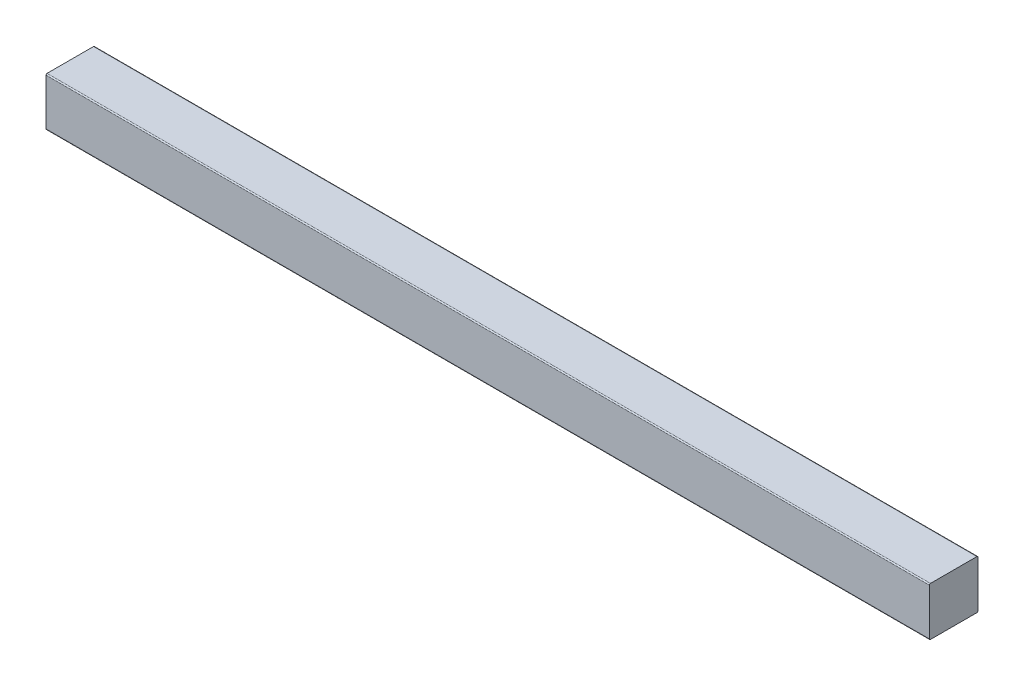
ISO-10303-21;
HEADER;
FILE_DESCRIPTION(('STEP AP214'),'2;1');
FILE_NAME('part.step','',(''),(''),'','','');
FILE_SCHEMA(('AUTOMOTIVE_DESIGN { 1 0 10303 214 1 1 1 1 }'));
ENDSEC;
DATA;
#1=APPLICATION_CONTEXT('core data for automotive mechanical design processes');
#2=APPLICATION_PROTOCOL_DEFINITION('international standard','automotive_design',2000,#1);
#3=PRODUCT_CONTEXT('',#1,'mechanical');
#4=PRODUCT('Part','Part','',(#3));
#5=PRODUCT_RELATED_PRODUCT_CATEGORY('part','',(#4));
#6=PRODUCT_DEFINITION_FORMATION('','',#4);
#7=PRODUCT_DEFINITION_CONTEXT('part definition',#1,'design');
#8=PRODUCT_DEFINITION('design','',#6,#7);
#9=PRODUCT_DEFINITION_SHAPE('','',#8);
#10=(LENGTH_UNIT() NAMED_UNIT(*) SI_UNIT(.MILLI.,.METRE.));
#11=(NAMED_UNIT(*) PLANE_ANGLE_UNIT() SI_UNIT($,.RADIAN.));
#12=(NAMED_UNIT(*) SI_UNIT($,.STERADIAN.) SOLID_ANGLE_UNIT());
#13=UNCERTAINTY_MEASURE_WITH_UNIT(LENGTH_MEASURE(1.E-05),#10,'distance_accuracy_value','');
#14=(GEOMETRIC_REPRESENTATION_CONTEXT(3) GLOBAL_UNCERTAINTY_ASSIGNED_CONTEXT((#13)) GLOBAL_UNIT_ASSIGNED_CONTEXT((#10,
#11,#12)) REPRESENTATION_CONTEXT('',''));
#15=CARTESIAN_POINT('',(0.,0.,0.));
#16=DIRECTION('',(0.,0.,1.));
#17=DIRECTION('',(1.,0.,0.));
#18=AXIS2_PLACEMENT_3D('',#15,#16,#17);
#19=CARTESIAN_POINT('',(800.,0.,0.));
#20=DIRECTION('',(0.,0.,-1.));
#21=DIRECTION('',(-1.,0.,0.));
#22=AXIS2_PLACEMENT_3D('',#19,#20,#21);
#23=PLANE('',#22);
#24=DIRECTION('',(0.,-1.,0.));
#25=VECTOR('',#24,1.);
#26=CARTESIAN_POINT('',(0.,0.,0.));
#27=LINE('',#26,#25);
#28=CARTESIAN_POINT('',(0.,43.,0.));
#29=VERTEX_POINT('',#28);
#30=CARTESIAN_POINT('',(0.,1.,0.));
#31=VERTEX_POINT('',#30);
#32=EDGE_CURVE('E148',#29,#31,#27,.T.);
#33=ORIENTED_EDGE('',*,*,#32,.T.);
#34=DIRECTION('',(-1.,0.,0.));
#35=VECTOR('',#34,1.);
#36=CARTESIAN_POINT('',(800.,1.,0.));
#37=LINE('',#36,#35);
#38=CARTESIAN_POINT('',(800.,1.,0.));
#39=VERTEX_POINT('',#38);
#40=EDGE_CURVE('E181',#31,#39,#37,.F.);
#41=ORIENTED_EDGE('',*,*,#40,.T.);
#42=DIRECTION('',(0.,-1.,0.));
#43=VECTOR('',#42,1.);
#44=CARTESIAN_POINT('',(800.,0.,0.));
#45=LINE('',#44,#43);
#46=CARTESIAN_POINT('',(800.,43.,0.));
#47=VERTEX_POINT('',#46);
#48=EDGE_CURVE('E146',#47,#39,#45,.T.);
#49=ORIENTED_EDGE('',*,*,#48,.F.);
#50=DIRECTION('',(-1.,0.,0.));
#51=VECTOR('',#50,1.);
#52=CARTESIAN_POINT('',(800.,43.,0.));
#53=LINE('',#52,#51);
#54=EDGE_CURVE('E177',#47,#29,#53,.T.);
#55=ORIENTED_EDGE('',*,*,#54,.T.);
#56=EDGE_LOOP('',(#33,#41,#49,#55));
#57=FACE_BOUND('',#56,.T.);
#58=ADVANCED_FACE('F45',(#57),#23,.F.);
#59=CARTESIAN_POINT('',(800.,0.,0.));
#60=DIRECTION('',(0.,1.,0.));
#61=DIRECTION('',(0.,0.,1.));
#62=AXIS2_PLACEMENT_3D('',#59,#60,#61);
#63=PLANE('',#62);
#64=DIRECTION('',(0.,0.,-1.));
#65=VECTOR('',#64,1.);
#66=CARTESIAN_POINT('',(0.,0.,0.));
#67=LINE('',#66,#65);
#68=CARTESIAN_POINT('',(0.,0.,-1.));
#69=VERTEX_POINT('',#68);
#70=CARTESIAN_POINT('',(0.,0.,-43.));
#71=VERTEX_POINT('',#70);
#72=EDGE_CURVE('E142',#69,#71,#67,.T.);
#73=ORIENTED_EDGE('',*,*,#72,.T.);
#74=DIRECTION('',(-1.,0.,0.));
#75=VECTOR('',#74,1.);
#76=CARTESIAN_POINT('',(800.,0.,-43.));
#77=LINE('',#76,#75);
#78=CARTESIAN_POINT('',(800.,0.,-43.));
#79=VERTEX_POINT('',#78);
#80=EDGE_CURVE('E117',#71,#79,#77,.F.);
#81=ORIENTED_EDGE('',*,*,#80,.T.);
#82=DIRECTION('',(0.,0.,-1.));
#83=VECTOR('',#82,1.);
#84=CARTESIAN_POINT('',(800.,0.,0.));
#85=LINE('',#84,#83);
#86=CARTESIAN_POINT('',(800.,0.,-1.));
#87=VERTEX_POINT('',#86);
#88=EDGE_CURVE('E188',#87,#79,#85,.T.);
#89=ORIENTED_EDGE('',*,*,#88,.F.);
#90=DIRECTION('',(-1.,0.,0.));
#91=VECTOR('',#90,1.);
#92=CARTESIAN_POINT('',(800.,0.,-1.));
#93=LINE('',#92,#91);
#94=EDGE_CURVE('E123',#87,#69,#93,.T.);
#95=ORIENTED_EDGE('',*,*,#94,.T.);
#96=EDGE_LOOP('',(#73,#81,#89,#95));
#97=FACE_BOUND('',#96,.T.);
#98=ADVANCED_FACE('F209',(#97),#63,.F.);
#99=CARTESIAN_POINT('',(800.,0.,-44.));
#100=DIRECTION('',(0.,0.,1.));
#101=DIRECTION('',(1.,0.,0.));
#102=AXIS2_PLACEMENT_3D('',#99,#100,#101);
#103=PLANE('',#102);
#104=DIRECTION('',(0.,1.,0.));
#105=VECTOR('',#104,1.);
#106=CARTESIAN_POINT('',(800.,0.,-44.));
#107=LINE('',#106,#105);
#108=CARTESIAN_POINT('',(800.,1.,-44.));
#109=VERTEX_POINT('',#108);
#110=CARTESIAN_POINT('',(800.,43.,-44.));
#111=VERTEX_POINT('',#110);
#112=EDGE_CURVE('E132',#109,#111,#107,.T.);
#113=ORIENTED_EDGE('',*,*,#112,.F.);
#114=DIRECTION('',(-1.,0.,0.));
#115=VECTOR('',#114,1.);
#116=CARTESIAN_POINT('',(800.,1.,-44.));
#117=LINE('',#116,#115);
#118=CARTESIAN_POINT('',(0.,1.,-44.));
#119=VERTEX_POINT('',#118);
#120=EDGE_CURVE('E116',#109,#119,#117,.T.);
#121=ORIENTED_EDGE('',*,*,#120,.T.);
#122=DIRECTION('',(0.,1.,0.));
#123=VECTOR('',#122,1.);
#124=CARTESIAN_POINT('',(0.,0.,-44.));
#125=LINE('',#124,#123);
#126=CARTESIAN_POINT('',(0.,43.,-44.));
#127=VERTEX_POINT('',#126);
#128=EDGE_CURVE('E130',#119,#127,#125,.T.);
#129=ORIENTED_EDGE('',*,*,#128,.T.);
#130=DIRECTION('',(-1.,0.,0.));
#131=VECTOR('',#130,1.);
#132=CARTESIAN_POINT('',(800.,43.,-44.));
#133=LINE('',#132,#131);
#134=EDGE_CURVE('E135',#127,#111,#133,.F.);
#135=ORIENTED_EDGE('',*,*,#134,.T.);
#136=EDGE_LOOP('',(#113,#121,#129,#135));
#137=FACE_BOUND('',#136,.T.);
#138=ADVANCED_FACE('F129',(#137),#103,.F.);
#139=CARTESIAN_POINT('',(800.,44.,0.));
#140=DIRECTION('',(0.,-1.,0.));
#141=DIRECTION('',(0.,0.,-1.));
#142=AXIS2_PLACEMENT_3D('',#139,#140,#141);
#143=PLANE('',#142);
#144=DIRECTION('',(0.,0.,1.));
#145=VECTOR('',#144,1.);
#146=CARTESIAN_POINT('',(800.,44.,0.));
#147=LINE('',#146,#145);
#148=CARTESIAN_POINT('',(800.,44.,-43.));
#149=VERTEX_POINT('',#148);
#150=CARTESIAN_POINT('',(800.,44.,-1.));
#151=VERTEX_POINT('',#150);
#152=EDGE_CURVE('E153',#149,#151,#147,.T.);
#153=ORIENTED_EDGE('',*,*,#152,.F.);
#154=DIRECTION('',(-1.,0.,0.));
#155=VECTOR('',#154,1.);
#156=CARTESIAN_POINT('',(800.,44.,-43.));
#157=LINE('',#156,#155);
#158=CARTESIAN_POINT('',(0.,44.,-43.));
#159=VERTEX_POINT('',#158);
#160=EDGE_CURVE('E11',#149,#159,#157,.T.);
#161=ORIENTED_EDGE('',*,*,#160,.T.);
#162=DIRECTION('',(0.,0.,1.));
#163=VECTOR('',#162,1.);
#164=CARTESIAN_POINT('',(0.,44.,0.));
#165=LINE('',#164,#163);
#166=CARTESIAN_POINT('',(0.,44.,-1.));
#167=VERTEX_POINT('',#166);
#168=EDGE_CURVE('E141',#159,#167,#165,.T.);
#169=ORIENTED_EDGE('',*,*,#168,.T.);
#170=DIRECTION('',(-1.,0.,0.));
#171=VECTOR('',#170,1.);
#172=CARTESIAN_POINT('',(800.,44.,-1.));
#173=LINE('',#172,#171);
#174=EDGE_CURVE('E54',#167,#151,#173,.F.);
#175=ORIENTED_EDGE('',*,*,#174,.T.);
#176=EDGE_LOOP('',(#153,#161,#169,#175));
#177=FACE_BOUND('',#176,.T.);
#178=ADVANCED_FACE('F216',(#177),#143,.F.);
#179=CARTESIAN_POINT('',(800.,0.,0.));
#180=DIRECTION('',(-1.,0.,0.));
#181=DIRECTION('',(0.,0.,1.));
#182=AXIS2_PLACEMENT_3D('',#179,#180,#181);
#183=PLANE('',#182);
#184=ORIENTED_EDGE('',*,*,#88,.T.);
#185=CARTESIAN_POINT('',(800.,1.,-43.));
#186=DIRECTION('',(-1.,0.,0.));
#187=DIRECTION('',(0.,0.,1.));
#188=AXIS2_PLACEMENT_3D('',#185,#186,#187);
#189=CIRCLE('',#188,1.);
#190=EDGE_CURVE('E174',#79,#109,#189,.F.);
#191=ORIENTED_EDGE('',*,*,#190,.T.);
#192=ORIENTED_EDGE('',*,*,#112,.T.);
#193=CARTESIAN_POINT('',(800.,43.,-43.));
#194=DIRECTION('',(-1.,0.,0.));
#195=DIRECTION('',(0.,0.,1.));
#196=AXIS2_PLACEMENT_3D('',#193,#194,#195);
#197=CIRCLE('',#196,1.);
#198=EDGE_CURVE('E67',#111,#149,#197,.F.);
#199=ORIENTED_EDGE('',*,*,#198,.T.);
#200=ORIENTED_EDGE('',*,*,#152,.T.);
#201=CARTESIAN_POINT('',(800.,43.,-1.));
#202=DIRECTION('',(-1.,0.,0.));
#203=DIRECTION('',(0.,0.,1.));
#204=AXIS2_PLACEMENT_3D('',#201,#202,#203);
#205=CIRCLE('',#204,1.);
#206=EDGE_CURVE('E166',#151,#47,#205,.F.);
#207=ORIENTED_EDGE('',*,*,#206,.T.);
#208=ORIENTED_EDGE('',*,*,#48,.T.);
#209=CARTESIAN_POINT('',(800.,1.,-1.));
#210=DIRECTION('',(-1.,0.,0.));
#211=DIRECTION('',(0.,0.,1.));
#212=AXIS2_PLACEMENT_3D('',#209,#210,#211);
#213=CIRCLE('',#212,1.);
#214=EDGE_CURVE('E171',#39,#87,#213,.F.);
#215=ORIENTED_EDGE('',*,*,#214,.T.);
#216=EDGE_LOOP('',(#184,#191,#192,#199,#200,#207,#208,#215));
#217=FACE_BOUND('',#216,.T.);
#218=ADVANCED_FACE('F207',(#217),#183,.F.);
#219=CARTESIAN_POINT('',(0.,0.,0.));
#220=DIRECTION('',(-1.,0.,0.));
#221=DIRECTION('',(0.,0.,1.));
#222=AXIS2_PLACEMENT_3D('',#219,#220,#221);
#223=PLANE('',#222);
#224=ORIENTED_EDGE('',*,*,#128,.F.);
#225=CARTESIAN_POINT('',(0.,1.,-43.));
#226=DIRECTION('',(-1.,0.,0.));
#227=DIRECTION('',(0.,0.,1.));
#228=AXIS2_PLACEMENT_3D('',#225,#226,#227);
#229=CIRCLE('',#228,1.);
#230=EDGE_CURVE('E112',#119,#71,#229,.T.);
#231=ORIENTED_EDGE('',*,*,#230,.T.);
#232=ORIENTED_EDGE('',*,*,#72,.F.);
#233=CARTESIAN_POINT('',(0.,1.,-1.));
#234=DIRECTION('',(-1.,0.,0.));
#235=DIRECTION('',(0.,0.,1.));
#236=AXIS2_PLACEMENT_3D('',#233,#234,#235);
#237=CIRCLE('',#236,1.);
#238=EDGE_CURVE('E124',#69,#31,#237,.T.);
#239=ORIENTED_EDGE('',*,*,#238,.T.);
#240=ORIENTED_EDGE('',*,*,#32,.F.);
#241=CARTESIAN_POINT('',(0.,43.,-1.));
#242=DIRECTION('',(-1.,0.,0.));
#243=DIRECTION('',(0.,0.,1.));
#244=AXIS2_PLACEMENT_3D('',#241,#242,#243);
#245=CIRCLE('',#244,1.);
#246=EDGE_CURVE('E134',#29,#167,#245,.T.);
#247=ORIENTED_EDGE('',*,*,#246,.T.);
#248=ORIENTED_EDGE('',*,*,#168,.F.);
#249=CARTESIAN_POINT('',(0.,43.,-43.));
#250=DIRECTION('',(-1.,0.,0.));
#251=DIRECTION('',(0.,0.,1.));
#252=AXIS2_PLACEMENT_3D('',#249,#250,#251);
#253=CIRCLE('',#252,1.);
#254=EDGE_CURVE('E139',#159,#127,#253,.T.);
#255=ORIENTED_EDGE('',*,*,#254,.T.);
#256=EDGE_LOOP('',(#224,#231,#232,#239,#240,#247,#248,#255));
#257=FACE_BOUND('',#256,.T.);
#258=ADVANCED_FACE('F137',(#257),#223,.T.);
#259=CARTESIAN_POINT('',(800.,1.,-43.));
#260=DIRECTION('',(-1.,0.,0.));
#261=DIRECTION('',(0.,0.,1.));
#262=AXIS2_PLACEMENT_3D('',#259,#260,#261);
#263=CYLINDRICAL_SURFACE('',#262,1.);
#264=ORIENTED_EDGE('',*,*,#190,.F.);
#265=ORIENTED_EDGE('',*,*,#80,.F.);
#266=ORIENTED_EDGE('',*,*,#230,.F.);
#267=ORIENTED_EDGE('',*,*,#120,.F.);
#268=EDGE_LOOP('',(#264,#265,#266,#267));
#269=FACE_BOUND('',#268,.T.);
#270=ADVANCED_FACE('F115',(#269),#263,.T.);
#271=CARTESIAN_POINT('',(800.,1.,-1.));
#272=DIRECTION('',(-1.,0.,0.));
#273=DIRECTION('',(0.,0.,1.));
#274=AXIS2_PLACEMENT_3D('',#271,#272,#273);
#275=CYLINDRICAL_SURFACE('',#274,1.);
#276=ORIENTED_EDGE('',*,*,#214,.F.);
#277=ORIENTED_EDGE('',*,*,#40,.F.);
#278=ORIENTED_EDGE('',*,*,#238,.F.);
#279=ORIENTED_EDGE('',*,*,#94,.F.);
#280=EDGE_LOOP('',(#276,#277,#278,#279));
#281=FACE_BOUND('',#280,.T.);
#282=ADVANCED_FACE('F204',(#281),#275,.T.);
#283=CARTESIAN_POINT('',(800.,43.,-43.));
#284=DIRECTION('',(-1.,0.,0.));
#285=DIRECTION('',(0.,0.,1.));
#286=AXIS2_PLACEMENT_3D('',#283,#284,#285);
#287=CYLINDRICAL_SURFACE('',#286,1.);
#288=ORIENTED_EDGE('',*,*,#198,.F.);
#289=ORIENTED_EDGE('',*,*,#134,.F.);
#290=ORIENTED_EDGE('',*,*,#254,.F.);
#291=ORIENTED_EDGE('',*,*,#160,.F.);
#292=EDGE_LOOP('',(#288,#289,#290,#291));
#293=FACE_BOUND('',#292,.T.);
#294=ADVANCED_FACE('F224',(#293),#287,.T.);
#295=CARTESIAN_POINT('',(800.,43.,-1.));
#296=DIRECTION('',(-1.,0.,0.));
#297=DIRECTION('',(0.,0.,1.));
#298=AXIS2_PLACEMENT_3D('',#295,#296,#297);
#299=CYLINDRICAL_SURFACE('',#298,1.);
#300=ORIENTED_EDGE('',*,*,#206,.F.);
#301=ORIENTED_EDGE('',*,*,#174,.F.);
#302=ORIENTED_EDGE('',*,*,#246,.F.);
#303=ORIENTED_EDGE('',*,*,#54,.F.);
#304=EDGE_LOOP('',(#300,#301,#302,#303));
#305=FACE_BOUND('',#304,.T.);
#306=ADVANCED_FACE('F47',(#305),#299,.T.);
#307=CLOSED_SHELL('',(#58,#98,#138,#178,#218,#258,#270,#282,#294,#306));
#308=MANIFOLD_SOLID_BREP('B2',#307);
#309=ADVANCED_BREP_SHAPE_REPRESENTATION('',(#18,#308),#14);
#310=SHAPE_DEFINITION_REPRESENTATION(#9,#309);
ENDSEC;
END-ISO-10303-21;
